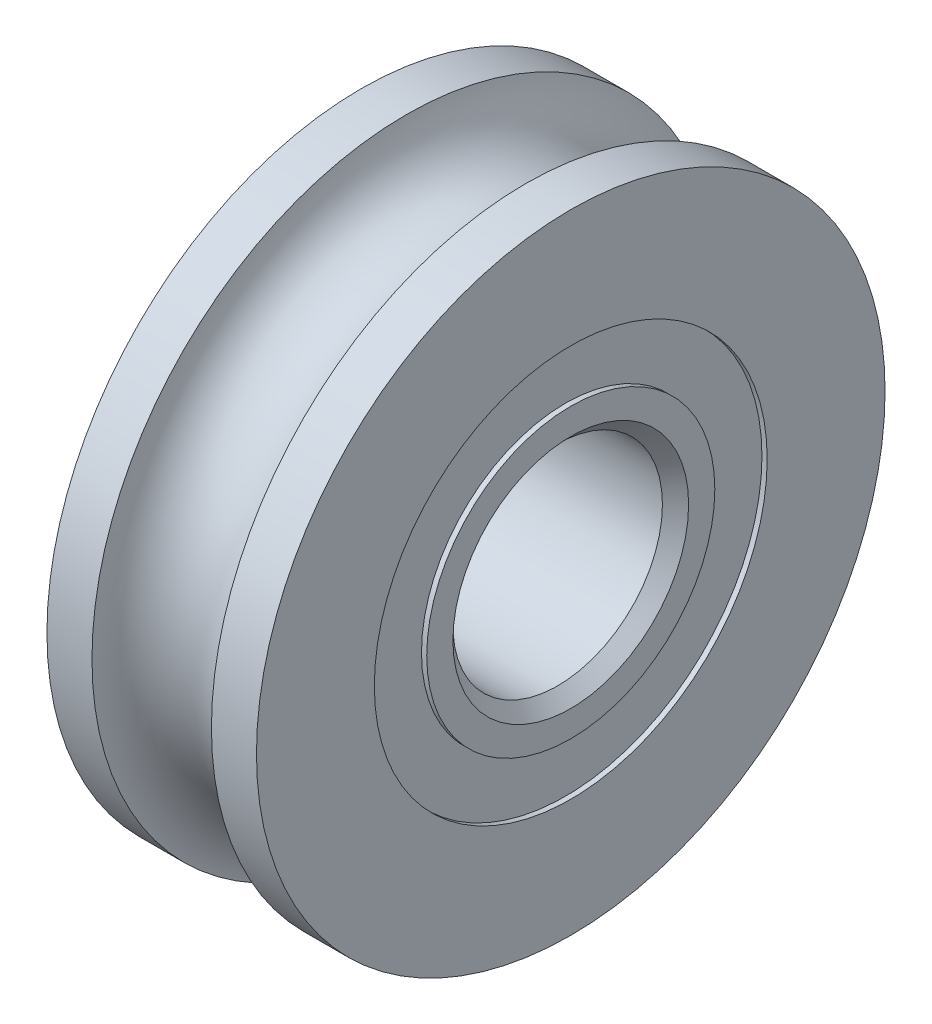
ISO-10303-21;
HEADER;
FILE_DESCRIPTION(('STEP AP214'),'2;1');
FILE_NAME('part.step','',(''),(''),'','','');
FILE_SCHEMA(('AUTOMOTIVE_DESIGN { 1 0 10303 214 1 1 1 1 }'));
ENDSEC;
DATA;
#1=APPLICATION_CONTEXT('core data for automotive mechanical design processes');
#2=APPLICATION_PROTOCOL_DEFINITION('international standard','automotive_design',2000,#1);
#3=PRODUCT_CONTEXT('',#1,'mechanical');
#4=PRODUCT('Part','Part','',(#3));
#5=PRODUCT_RELATED_PRODUCT_CATEGORY('part','',(#4));
#6=PRODUCT_DEFINITION_FORMATION('','',#4);
#7=PRODUCT_DEFINITION_CONTEXT('part definition',#1,'design');
#8=PRODUCT_DEFINITION('design','',#6,#7);
#9=PRODUCT_DEFINITION_SHAPE('','',#8);
#10=(LENGTH_UNIT() NAMED_UNIT(*) SI_UNIT(.MILLI.,.METRE.));
#11=(NAMED_UNIT(*) PLANE_ANGLE_UNIT() SI_UNIT($,.RADIAN.));
#12=(NAMED_UNIT(*) SI_UNIT($,.STERADIAN.) SOLID_ANGLE_UNIT());
#13=UNCERTAINTY_MEASURE_WITH_UNIT(LENGTH_MEASURE(1.E-05),#10,'distance_accuracy_value','');
#14=(GEOMETRIC_REPRESENTATION_CONTEXT(3) GLOBAL_UNCERTAINTY_ASSIGNED_CONTEXT((#13)) GLOBAL_UNIT_ASSIGNED_CONTEXT((#10,
#11,#12)) REPRESENTATION_CONTEXT('',''));
#15=CARTESIAN_POINT('',(0.,0.,0.));
#16=DIRECTION('',(0.,0.,1.));
#17=DIRECTION('',(1.,0.,0.));
#18=AXIS2_PLACEMENT_3D('',#15,#16,#17);
#19=CARTESIAN_POINT('',(-2.,6.,0.));
#20=DIRECTION('',(-1.,0.,0.));
#21=DIRECTION('',(0.,0.,1.));
#22=AXIS2_PLACEMENT_3D('',#19,#20,#21);
#23=PLANE('',#22);
#24=CARTESIAN_POINT('',(-2.,0.,0.));
#25=DIRECTION('',(1.,0.,0.));
#26=DIRECTION('',(0.,0.,-1.));
#27=AXIS2_PLACEMENT_3D('',#24,#25,#26);
#28=CIRCLE('',#27,3.75);
#29=CARTESIAN_POINT('',(-2.,0.,-3.75));
#30=VERTEX_POINT('',#29);
#31=EDGE_CURVE('E67',#30,#30,#28,.T.);
#32=ORIENTED_EDGE('',*,*,#31,.T.);
#33=EDGE_LOOP('',(#32));
#34=FACE_BOUND('',#33,.T.);
#35=CARTESIAN_POINT('',(-2.,0.,0.));
#36=DIRECTION('',(1.,0.,0.));
#37=DIRECTION('',(0.,0.,-1.));
#38=AXIS2_PLACEMENT_3D('',#35,#36,#37);
#39=CIRCLE('',#38,6.);
#40=CARTESIAN_POINT('',(-2.,0.,-6.));
#41=VERTEX_POINT('',#40);
#42=EDGE_CURVE('E64',#41,#41,#39,.T.);
#43=ORIENTED_EDGE('',*,*,#42,.F.);
#44=EDGE_LOOP('',(#43));
#45=FACE_BOUND('',#44,.T.);
#46=ADVANCED_FACE('F14',(#34,#45),#23,.T.);
#47=CARTESIAN_POINT('',(2.,0.,0.));
#48=DIRECTION('',(1.,0.,0.));
#49=DIRECTION('',(0.,0.,-1.));
#50=AXIS2_PLACEMENT_3D('',#47,#48,#49);
#51=CYLINDRICAL_SURFACE('',#50,3.75);
#52=CARTESIAN_POINT('',(-1.9,0.,0.));
#53=DIRECTION('',(1.,0.,0.));
#54=DIRECTION('',(0.,0.,-1.));
#55=AXIS2_PLACEMENT_3D('',#52,#53,#54);
#56=CIRCLE('',#55,3.75);
#57=CARTESIAN_POINT('',(-1.9,0.,-3.75));
#58=VERTEX_POINT('',#57);
#59=EDGE_CURVE('E61',#58,#58,#56,.T.);
#60=ORIENTED_EDGE('',*,*,#59,.T.);
#61=EDGE_LOOP('',(#60));
#62=FACE_BOUND('',#61,.T.);
#63=ORIENTED_EDGE('',*,*,#31,.F.);
#64=EDGE_LOOP('',(#63));
#65=FACE_BOUND('',#64,.T.);
#66=ADVANCED_FACE('F73',(#62,#65),#51,.F.);
#67=CARTESIAN_POINT('',(2.,0.,0.));
#68=DIRECTION('',(1.,0.,0.));
#69=DIRECTION('',(0.,0.,-1.));
#70=AXIS2_PLACEMENT_3D('',#67,#68,#69);
#71=CYLINDRICAL_SURFACE('',#70,6.);
#72=ORIENTED_EDGE('',*,*,#42,.T.);
#73=EDGE_LOOP('',(#72));
#74=FACE_BOUND('',#73,.T.);
#75=CARTESIAN_POINT('',(-1.1401754250991,0.,0.));
#76=DIRECTION('',(1.,0.,0.));
#77=DIRECTION('',(0.,0.,-1.));
#78=AXIS2_PLACEMENT_3D('',#75,#76,#77);
#79=CIRCLE('',#78,6.);
#80=CARTESIAN_POINT('',(-1.1401754250991,0.,-6.));
#81=VERTEX_POINT('',#80);
#82=EDGE_CURVE('E58',#81,#81,#79,.T.);
#83=ORIENTED_EDGE('',*,*,#82,.F.);
#84=EDGE_LOOP('',(#83));
#85=FACE_BOUND('',#84,.T.);
#86=ADVANCED_FACE('F75',(#74,#85),#71,.T.);
#87=CARTESIAN_POINT('',(-1.9,3.75,0.));
#88=DIRECTION('',(-1.,0.,0.));
#89=DIRECTION('',(0.,0.,1.));
#90=AXIS2_PLACEMENT_3D('',#87,#88,#89);
#91=PLANE('',#90);
#92=CARTESIAN_POINT('',(-1.9,0.,0.));
#93=DIRECTION('',(1.,0.,0.));
#94=DIRECTION('',(0.,0.,-1.));
#95=AXIS2_PLACEMENT_3D('',#92,#93,#94);
#96=CIRCLE('',#95,2.75);
#97=CARTESIAN_POINT('',(-1.9,0.,-2.75));
#98=VERTEX_POINT('',#97);
#99=EDGE_CURVE('E55',#98,#98,#96,.T.);
#100=ORIENTED_EDGE('',*,*,#99,.T.);
#101=EDGE_LOOP('',(#100));
#102=FACE_BOUND('',#101,.T.);
#103=ORIENTED_EDGE('',*,*,#59,.F.);
#104=EDGE_LOOP('',(#103));
#105=FACE_BOUND('',#104,.T.);
#106=ADVANCED_FACE('F83',(#102,#105),#91,.T.);
#107=CARTESIAN_POINT('',(0.,0.,0.));
#108=DIRECTION('',(1.,0.,0.));
#109=DIRECTION('',(0.,0.,-1.));
#110=AXIS2_PLACEMENT_3D('',#107,#108,#109);
#111=TOROIDAL_SURFACE('',#110,6.15,1.14999999999996);
#112=CARTESIAN_POINT('',(1.1401754250991,0.,0.));
#113=DIRECTION('',(1.,0.,0.));
#114=DIRECTION('',(0.,0.,-1.));
#115=AXIS2_PLACEMENT_3D('',#112,#113,#114);
#116=CIRCLE('',#115,6.);
#117=CARTESIAN_POINT('',(1.1401754250991,0.,-6.));
#118=VERTEX_POINT('',#117);
#119=EDGE_CURVE('E52',#118,#118,#116,.T.);
#120=ORIENTED_EDGE('',*,*,#119,.F.);
#121=EDGE_LOOP('',(#120));
#122=FACE_BOUND('',#121,.T.);
#123=ORIENTED_EDGE('',*,*,#82,.T.);
#124=EDGE_LOOP('',(#123));
#125=FACE_BOUND('',#124,.T.);
#126=ADVANCED_FACE('F90',(#122,#125),#111,.F.);
#127=CARTESIAN_POINT('',(2.,0.,0.));
#128=DIRECTION('',(1.,0.,0.));
#129=DIRECTION('',(0.,0.,-1.));
#130=AXIS2_PLACEMENT_3D('',#127,#128,#129);
#131=CYLINDRICAL_SURFACE('',#130,2.75);
#132=CARTESIAN_POINT('',(-2.,0.,0.));
#133=DIRECTION('',(1.,0.,0.));
#134=DIRECTION('',(0.,0.,-1.));
#135=AXIS2_PLACEMENT_3D('',#132,#133,#134);
#136=CIRCLE('',#135,2.75);
#137=CARTESIAN_POINT('',(-2.,0.,-2.75));
#138=VERTEX_POINT('',#137);
#139=EDGE_CURVE('E49',#138,#138,#136,.T.);
#140=ORIENTED_EDGE('',*,*,#139,.T.);
#141=EDGE_LOOP('',(#140));
#142=FACE_BOUND('',#141,.T.);
#143=ORIENTED_EDGE('',*,*,#99,.F.);
#144=EDGE_LOOP('',(#143));
#145=FACE_BOUND('',#144,.T.);
#146=ADVANCED_FACE('F94',(#142,#145),#131,.T.);
#147=CARTESIAN_POINT('',(2.,0.,0.));
#148=DIRECTION('',(1.,0.,0.));
#149=DIRECTION('',(0.,0.,-1.));
#150=AXIS2_PLACEMENT_3D('',#147,#148,#149);
#151=CYLINDRICAL_SURFACE('',#150,6.);
#152=ORIENTED_EDGE('',*,*,#119,.T.);
#153=EDGE_LOOP('',(#152));
#154=FACE_BOUND('',#153,.T.);
#155=CARTESIAN_POINT('',(2.,0.,0.));
#156=DIRECTION('',(1.,0.,0.));
#157=DIRECTION('',(0.,0.,-1.));
#158=AXIS2_PLACEMENT_3D('',#155,#156,#157);
#159=CIRCLE('',#158,6.);
#160=CARTESIAN_POINT('',(2.,0.,-6.));
#161=VERTEX_POINT('',#160);
#162=EDGE_CURVE('E46',#161,#161,#159,.T.);
#163=ORIENTED_EDGE('',*,*,#162,.F.);
#164=EDGE_LOOP('',(#163));
#165=FACE_BOUND('',#164,.T.);
#166=ADVANCED_FACE('F98',(#154,#165),#151,.T.);
#167=CARTESIAN_POINT('',(-2.,2.75,0.));
#168=DIRECTION('',(-1.,0.,0.));
#169=DIRECTION('',(0.,0.,1.));
#170=AXIS2_PLACEMENT_3D('',#167,#168,#169);
#171=PLANE('',#170);
#172=CARTESIAN_POINT('',(-2.,0.,0.));
#173=DIRECTION('',(1.,0.,0.));
#174=DIRECTION('',(0.,0.,-1.));
#175=AXIS2_PLACEMENT_3D('',#172,#173,#174);
#176=CIRCLE('',#175,2.25);
#177=CARTESIAN_POINT('',(-2.,0.,-2.25));
#178=VERTEX_POINT('',#177);
#179=EDGE_CURVE('E43',#178,#178,#176,.T.);
#180=ORIENTED_EDGE('',*,*,#179,.T.);
#181=EDGE_LOOP('',(#180));
#182=FACE_BOUND('',#181,.T.);
#183=ORIENTED_EDGE('',*,*,#139,.F.);
#184=EDGE_LOOP('',(#183));
#185=FACE_BOUND('',#184,.T.);
#186=ADVANCED_FACE('F102',(#182,#185),#171,.T.);
#187=CARTESIAN_POINT('',(2.,3.75,0.));
#188=DIRECTION('',(1.,0.,0.));
#189=DIRECTION('',(0.,0.,-1.));
#190=AXIS2_PLACEMENT_3D('',#187,#188,#189);
#191=PLANE('',#190);
#192=ORIENTED_EDGE('',*,*,#162,.T.);
#193=EDGE_LOOP('',(#192));
#194=FACE_BOUND('',#193,.T.);
#195=CARTESIAN_POINT('',(2.,0.,0.));
#196=DIRECTION('',(1.,0.,0.));
#197=DIRECTION('',(0.,0.,-1.));
#198=AXIS2_PLACEMENT_3D('',#195,#196,#197);
#199=CIRCLE('',#198,3.75);
#200=CARTESIAN_POINT('',(2.,0.,-3.75));
#201=VERTEX_POINT('',#200);
#202=EDGE_CURVE('E40',#201,#201,#199,.T.);
#203=ORIENTED_EDGE('',*,*,#202,.F.);
#204=EDGE_LOOP('',(#203));
#205=FACE_BOUND('',#204,.T.);
#206=ADVANCED_FACE('F106',(#194,#205),#191,.T.);
#207=CARTESIAN_POINT('',(-2.,0.,0.));
#208=DIRECTION('',(-1.,0.,0.));
#209=DIRECTION('',(0.,0.,1.));
#210=AXIS2_PLACEMENT_3D('',#207,#208,#209);
#211=CONICAL_SURFACE('',#210,2.25,0.785398163397448);
#212=CARTESIAN_POINT('',(-1.75,0.,0.));
#213=DIRECTION('',(1.,0.,0.));
#214=DIRECTION('',(0.,0.,-1.));
#215=AXIS2_PLACEMENT_3D('',#212,#213,#214);
#216=CIRCLE('',#215,2.);
#217=CARTESIAN_POINT('',(-1.75,0.,-2.));
#218=VERTEX_POINT('',#217);
#219=EDGE_CURVE('E37',#218,#218,#216,.T.);
#220=ORIENTED_EDGE('',*,*,#219,.T.);
#221=EDGE_LOOP('',(#220));
#222=FACE_BOUND('',#221,.T.);
#223=ORIENTED_EDGE('',*,*,#179,.F.);
#224=EDGE_LOOP('',(#223));
#225=FACE_BOUND('',#224,.T.);
#226=ADVANCED_FACE('F110',(#222,#225),#211,.F.);
#227=CARTESIAN_POINT('',(2.,0.,0.));
#228=DIRECTION('',(1.,0.,0.));
#229=DIRECTION('',(0.,0.,-1.));
#230=AXIS2_PLACEMENT_3D('',#227,#228,#229);
#231=CYLINDRICAL_SURFACE('',#230,3.75);
#232=ORIENTED_EDGE('',*,*,#202,.T.);
#233=EDGE_LOOP('',(#232));
#234=FACE_BOUND('',#233,.T.);
#235=CARTESIAN_POINT('',(1.9,0.,0.));
#236=DIRECTION('',(1.,0.,0.));
#237=DIRECTION('',(0.,0.,-1.));
#238=AXIS2_PLACEMENT_3D('',#235,#236,#237);
#239=CIRCLE('',#238,3.75);
#240=CARTESIAN_POINT('',(1.9,0.,-3.75));
#241=VERTEX_POINT('',#240);
#242=EDGE_CURVE('E34',#241,#241,#239,.T.);
#243=ORIENTED_EDGE('',*,*,#242,.F.);
#244=EDGE_LOOP('',(#243));
#245=FACE_BOUND('',#244,.T.);
#246=ADVANCED_FACE('F114',(#234,#245),#231,.F.);
#247=CARTESIAN_POINT('',(2.,0.,0.));
#248=DIRECTION('',(1.,0.,0.));
#249=DIRECTION('',(0.,0.,-1.));
#250=AXIS2_PLACEMENT_3D('',#247,#248,#249);
#251=CYLINDRICAL_SURFACE('',#250,2.);
#252=CARTESIAN_POINT('',(1.75,0.,0.));
#253=DIRECTION('',(1.,0.,0.));
#254=DIRECTION('',(0.,0.,-1.));
#255=AXIS2_PLACEMENT_3D('',#252,#253,#254);
#256=CIRCLE('',#255,2.);
#257=CARTESIAN_POINT('',(1.75,0.,-2.));
#258=VERTEX_POINT('',#257);
#259=EDGE_CURVE('E29',#258,#258,#256,.T.);
#260=ORIENTED_EDGE('',*,*,#259,.T.);
#261=EDGE_LOOP('',(#260));
#262=FACE_BOUND('',#261,.T.);
#263=ORIENTED_EDGE('',*,*,#219,.F.);
#264=EDGE_LOOP('',(#263));
#265=FACE_BOUND('',#264,.T.);
#266=ADVANCED_FACE('F118',(#262,#265),#251,.F.);
#267=CARTESIAN_POINT('',(1.9,2.75,0.));
#268=DIRECTION('',(1.,0.,0.));
#269=DIRECTION('',(0.,0.,-1.));
#270=AXIS2_PLACEMENT_3D('',#267,#268,#269);
#271=PLANE('',#270);
#272=ORIENTED_EDGE('',*,*,#242,.T.);
#273=EDGE_LOOP('',(#272));
#274=FACE_BOUND('',#273,.T.);
#275=CARTESIAN_POINT('',(1.9,0.,0.));
#276=DIRECTION('',(1.,0.,0.));
#277=DIRECTION('',(0.,0.,-1.));
#278=AXIS2_PLACEMENT_3D('',#275,#276,#277);
#279=CIRCLE('',#278,2.75);
#280=CARTESIAN_POINT('',(1.9,0.,-2.75));
#281=VERTEX_POINT('',#280);
#282=EDGE_CURVE('E25',#281,#281,#279,.T.);
#283=ORIENTED_EDGE('',*,*,#282,.F.);
#284=EDGE_LOOP('',(#283));
#285=FACE_BOUND('',#284,.T.);
#286=ADVANCED_FACE('F122',(#274,#285),#271,.T.);
#287=CARTESIAN_POINT('',(1.75,0.,0.));
#288=DIRECTION('',(1.,0.,0.));
#289=DIRECTION('',(0.,0.,-1.));
#290=AXIS2_PLACEMENT_3D('',#287,#288,#289);
#291=CONICAL_SURFACE('',#290,2.,0.785398163397449);
#292=CARTESIAN_POINT('',(2.,0.,0.));
#293=DIRECTION('',(1.,0.,0.));
#294=DIRECTION('',(0.,0.,-1.));
#295=AXIS2_PLACEMENT_3D('',#292,#293,#294);
#296=CIRCLE('',#295,2.25);
#297=CARTESIAN_POINT('',(2.,0.,-2.25));
#298=VERTEX_POINT('',#297);
#299=EDGE_CURVE('E21',#298,#298,#296,.T.);
#300=ORIENTED_EDGE('',*,*,#299,.T.);
#301=EDGE_LOOP('',(#300));
#302=FACE_BOUND('',#301,.T.);
#303=ORIENTED_EDGE('',*,*,#259,.F.);
#304=EDGE_LOOP('',(#303));
#305=FACE_BOUND('',#304,.T.);
#306=ADVANCED_FACE('F126',(#302,#305),#291,.F.);
#307=CARTESIAN_POINT('',(2.,0.,0.));
#308=DIRECTION('',(1.,0.,0.));
#309=DIRECTION('',(0.,0.,-1.));
#310=AXIS2_PLACEMENT_3D('',#307,#308,#309);
#311=CYLINDRICAL_SURFACE('',#310,2.75);
#312=ORIENTED_EDGE('',*,*,#282,.T.);
#313=EDGE_LOOP('',(#312));
#314=FACE_BOUND('',#313,.T.);
#315=CARTESIAN_POINT('',(2.,0.,0.));
#316=DIRECTION('',(1.,0.,0.));
#317=DIRECTION('',(0.,0.,-1.));
#318=AXIS2_PLACEMENT_3D('',#315,#316,#317);
#319=CIRCLE('',#318,2.75);
#320=CARTESIAN_POINT('',(2.,0.,-2.75));
#321=VERTEX_POINT('',#320);
#322=EDGE_CURVE('E9',#321,#321,#319,.T.);
#323=ORIENTED_EDGE('',*,*,#322,.F.);
#324=EDGE_LOOP('',(#323));
#325=FACE_BOUND('',#324,.T.);
#326=ADVANCED_FACE('F129',(#314,#325),#311,.T.);
#327=CARTESIAN_POINT('',(2.,2.25,0.));
#328=DIRECTION('',(1.,0.,0.));
#329=DIRECTION('',(0.,0.,-1.));
#330=AXIS2_PLACEMENT_3D('',#327,#328,#329);
#331=PLANE('',#330);
#332=ORIENTED_EDGE('',*,*,#322,.T.);
#333=EDGE_LOOP('',(#332));
#334=FACE_BOUND('',#333,.T.);
#335=ORIENTED_EDGE('',*,*,#299,.F.);
#336=EDGE_LOOP('',(#335));
#337=FACE_BOUND('',#336,.T.);
#338=ADVANCED_FACE('F16',(#334,#337),#331,.T.);
#339=CLOSED_SHELL('',(#46,#66,#86,#106,#126,#146,#166,#186,#206,#226,#246,#266,#286,#306,#326,#338));
#340=MANIFOLD_SOLID_BREP('B1',#339);
#341=ADVANCED_BREP_SHAPE_REPRESENTATION('',(#18,#340),#14);
#342=SHAPE_DEFINITION_REPRESENTATION(#9,#341);
ENDSEC;
END-ISO-10303-21;
